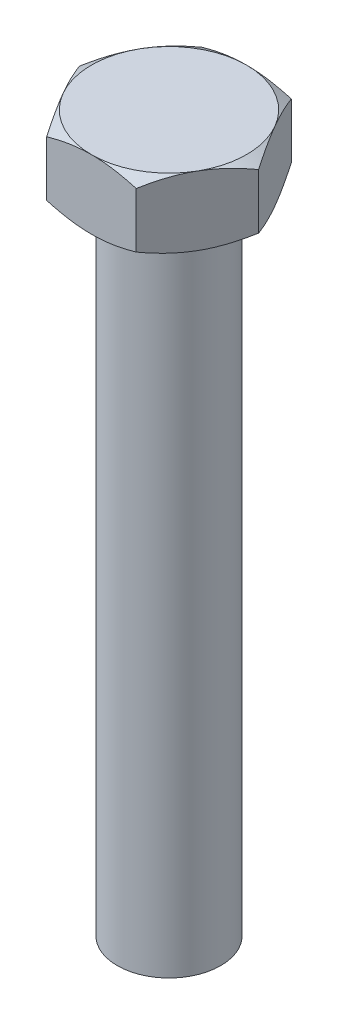
ISO-10303-21;
HEADER;
FILE_DESCRIPTION(('STEP AP214'),'2;1');
FILE_NAME('part.step','',(''),(''),'','','');
FILE_SCHEMA(('AUTOMOTIVE_DESIGN { 1 0 10303 214 1 1 1 1 }'));
ENDSEC;
DATA;
#1=APPLICATION_CONTEXT('core data for automotive mechanical design processes');
#2=APPLICATION_PROTOCOL_DEFINITION('international standard','automotive_design',2000,#1);
#3=PRODUCT_CONTEXT('',#1,'mechanical');
#4=PRODUCT('Part','Part','',(#3));
#5=PRODUCT_RELATED_PRODUCT_CATEGORY('part','',(#4));
#6=PRODUCT_DEFINITION_FORMATION('','',#4);
#7=PRODUCT_DEFINITION_CONTEXT('part definition',#1,'design');
#8=PRODUCT_DEFINITION('design','',#6,#7);
#9=PRODUCT_DEFINITION_SHAPE('','',#8);
#10=(LENGTH_UNIT() NAMED_UNIT(*) SI_UNIT(.MILLI.,.METRE.));
#11=(NAMED_UNIT(*) PLANE_ANGLE_UNIT() SI_UNIT($,.RADIAN.));
#12=(NAMED_UNIT(*) SI_UNIT($,.STERADIAN.) SOLID_ANGLE_UNIT());
#13=UNCERTAINTY_MEASURE_WITH_UNIT(LENGTH_MEASURE(1.E-05),#10,'distance_accuracy_value','');
#14=(GEOMETRIC_REPRESENTATION_CONTEXT(3) GLOBAL_UNCERTAINTY_ASSIGNED_CONTEXT((#13)) GLOBAL_UNIT_ASSIGNED_CONTEXT((#10,
#11,#12)) REPRESENTATION_CONTEXT('',''));
#15=CARTESIAN_POINT('',(0.,0.,0.));
#16=DIRECTION('',(0.,0.,1.));
#17=DIRECTION('',(1.,0.,0.));
#18=AXIS2_PLACEMENT_3D('',#15,#16,#17);
#19=CARTESIAN_POINT('',(0.,0.,0.));
#20=DIRECTION('',(0.,1.,0.));
#21=DIRECTION('',(0.,0.,1.));
#22=AXIS2_PLACEMENT_3D('',#19,#20,#21);
#23=PLANE('',#22);
#24=CARTESIAN_POINT('',(0.,0.,0.));
#25=DIRECTION('',(0.,1.,0.));
#26=DIRECTION('',(0.,0.,1.));
#27=AXIS2_PLACEMENT_3D('',#24,#25,#26);
#28=CIRCLE('',#27,9.);
#29=CARTESIAN_POINT('',(0.,0.,9.));
#30=VERTEX_POINT('',#29);
#31=CARTESIAN_POINT('',(7.79422863405995,0.,4.5));
#32=VERTEX_POINT('',#31);
#33=EDGE_CURVE('E262',#30,#32,#28,.T.);
#34=ORIENTED_EDGE('',*,*,#33,.F.);
#35=CARTESIAN_POINT('',(0.,0.,0.));
#36=DIRECTION('',(0.,1.,0.));
#37=DIRECTION('',(0.,0.,1.));
#38=AXIS2_PLACEMENT_3D('',#35,#36,#37);
#39=CIRCLE('',#38,9.);
#40=CARTESIAN_POINT('',(-7.79422863405995,0.,4.5));
#41=VERTEX_POINT('',#40);
#42=EDGE_CURVE('E289',#30,#41,#39,.F.);
#43=ORIENTED_EDGE('',*,*,#42,.T.);
#44=CARTESIAN_POINT('',(-7.79422863405995,0.,-4.5));
#45=VERTEX_POINT('',#44);
#46=EDGE_CURVE('E293',#41,#45,#39,.F.);
#47=ORIENTED_EDGE('',*,*,#46,.T.);
#48=CARTESIAN_POINT('',(0.,0.,-9.));
#49=VERTEX_POINT('',#48);
#50=EDGE_CURVE('E317',#45,#49,#39,.F.);
#51=ORIENTED_EDGE('',*,*,#50,.T.);
#52=CARTESIAN_POINT('',(7.79422863405995,0.,-4.5));
#53=VERTEX_POINT('',#52);
#54=EDGE_CURVE('E314',#49,#53,#39,.F.);
#55=ORIENTED_EDGE('',*,*,#54,.T.);
#56=EDGE_CURVE('E294',#53,#32,#39,.F.);
#57=ORIENTED_EDGE('',*,*,#56,.T.);
#58=EDGE_LOOP('',(#34,#43,#47,#51,#55,#57));
#59=FACE_BOUND('',#58,.T.);
#60=CARTESIAN_POINT('',(0.,0.,0.));
#61=DIRECTION('',(0.,1.,0.));
#62=DIRECTION('',(0.,0.,1.));
#63=AXIS2_PLACEMENT_3D('',#60,#61,#62);
#64=CIRCLE('',#63,6.);
#65=CARTESIAN_POINT('',(0.,0.,6.));
#66=VERTEX_POINT('',#65);
#67=EDGE_CURVE('E11',#66,#66,#64,.F.);
#68=ORIENTED_EDGE('',*,*,#67,.F.);
#69=EDGE_LOOP('',(#68));
#70=FACE_BOUND('',#69,.T.);
#71=ADVANCED_FACE('F36',(#59,#70),#23,.F.);
#72=CARTESIAN_POINT('',(10.3923048454133,8.,0.));
#73=DIRECTION('',(-0.866025403784438,0.,0.5));
#74=DIRECTION('',(0.5,0.,0.866025403784438));
#75=AXIS2_PLACEMENT_3D('',#72,#73,#74);
#76=PLANE('',#75);
#77=DIRECTION('',(0.,-1.,0.));
#78=VECTOR('',#77,1.);
#79=CARTESIAN_POINT('',(5.19615242270663,8.,-9.));
#80=LINE('',#79,#78);
#81=CARTESIAN_POINT('',(5.19615242270663,7.19615242270664,-9.));
#82=VERTEX_POINT('',#81);
#83=CARTESIAN_POINT('',(5.19615242270663,0.803847577293355,-9.));
#84=VERTEX_POINT('',#83);
#85=EDGE_CURVE('E295',#82,#84,#80,.T.);
#86=ORIENTED_EDGE('',*,*,#85,.F.);
#87=CARTESIAN_POINT('',(5.19603695265279,7.19608575492888,-9.0002));
#88=CARTESIAN_POINT('',(5.31024090414014,7.26201799812596,-8.80239295359879));
#89=CARTESIAN_POINT('',(5.42489028935503,7.3249585907897,-8.60381439335006));
#90=CARTESIAN_POINT('',(5.65512011728599,7.44403100234447,-8.20504463395579));
#91=CARTESIAN_POINT('',(5.77070093910682,7.50015988224795,-8.00485277818155));
#92=CARTESIAN_POINT('',(6.00300811711761,7.60484803927104,-7.60248494290391));
#93=CARTESIAN_POINT('',(6.11973652630803,7.65338922708722,-7.40030540749941));
#94=CARTESIAN_POINT('',(6.35398725476076,7.74185148321209,-6.99457124410926));
#95=CARTESIAN_POINT('',(6.47150940676615,7.78177431251673,-6.7910169058211));
#96=CARTESIAN_POINT('',(6.70436794207327,7.85131532585289,-6.38769409169309));
#97=CARTESIAN_POINT('',(6.81968712510142,7.88116249715221,-6.187955407601));
#98=CARTESIAN_POINT('',(7.05084147798785,7.93120669014092,-5.78758432401101));
#99=CARTESIAN_POINT('',(7.16667660134328,7.95140456446246,-5.5869520050584));
#100=CARTESIAN_POINT('',(7.39854776775318,7.98164565260265,-5.18533936402619));
#101=CARTESIAN_POINT('',(7.51458343241836,7.9917003904157,-4.98435969733607));
#102=CARTESIAN_POINT('',(7.74676155069016,8.00143766485492,-4.58221540008358));
#103=CARTESIAN_POINT('',(7.86290400088661,8.00112052193525,-4.38105077542779));
#104=CARTESIAN_POINT('',(8.08003584616207,7.99083604784683,-4.00496738746951));
#105=CARTESIAN_POINT('',(8.18104055171995,7.98212325996961,-3.83002210563972));
#106=CARTESIAN_POINT('',(8.38281337570171,7.95702265993463,-3.48054132291666));
#107=CARTESIAN_POINT('',(8.4835814777175,7.94063433041933,-3.30600585044304));
#108=CARTESIAN_POINT('',(8.7854956741391,7.88034344376417,-2.7830751227145));
#109=CARTESIAN_POINT('',(8.98610736306936,7.82532251765887,-2.43560548489509));
#110=CARTESIAN_POINT('',(9.38945876049729,7.68776952367485,-1.736980371246));
#111=CARTESIAN_POINT('',(9.59214699192736,7.6046543813729,-1.38591405631283));
#112=CARTESIAN_POINT('',(9.99450087051226,7.41601746056355,-0.689016695981396));
#113=CARTESIAN_POINT('',(10.1941716700214,7.31053998710665,-0.343176726443722));
#114=CARTESIAN_POINT('',(10.3924203154671,7.19608575492888,0.000199999999999235));
#115=B_SPLINE_CURVE_WITH_KNOTS('',3,(#87,#88,#89,#90,#91,#92,#93,#94,#95,#96,#97,#98,#99,#100,
#101,#102,#103,#104,#105,#106,#107,#108,#109,#110,#111,#112,#113,#114),.UNSPECIFIED.,.F.,.F.,(4,
2,2,2,2,2,2,2,2,2,2,2,2,4),(0.,0.713219249102576,1.42674513853509,2.14194697262263,
2.8570025303448,3.55449749123033,4.25193080859214,4.94857085059644,5.64518936892662,
6.25162976378283,6.8581110406634,8.07193747617893,9.31268391793541,10.5509947443908),.UNSPECIFIED.);
#116=CARTESIAN_POINT('',(7.79422863405995,8.,-4.5));
#117=VERTEX_POINT('',#116);
#118=EDGE_CURVE('E136',#82,#117,#115,.T.);
#119=ORIENTED_EDGE('',*,*,#118,.T.);
#120=CARTESIAN_POINT('',(10.3923048454133,7.19615242270664,0.));
#121=VERTEX_POINT('',#120);
#122=EDGE_CURVE('E159',#117,#121,#115,.T.);
#123=ORIENTED_EDGE('',*,*,#122,.T.);
#124=DIRECTION('',(0.,-1.,0.));
#125=VECTOR('',#124,1.);
#126=CARTESIAN_POINT('',(10.3923048454133,8.,0.));
#127=LINE('',#126,#125);
#128=CARTESIAN_POINT('',(10.3923048454133,0.803847577293357,0.));
#129=VERTEX_POINT('',#128);
#130=EDGE_CURVE('E301',#121,#129,#127,.T.);
#131=ORIENTED_EDGE('',*,*,#130,.T.);
#132=CARTESIAN_POINT('',(10.3924203154671,0.803914245071122,0.000200000000000067));
#133=CARTESIAN_POINT('',(10.2782163639798,0.737982001874045,-0.197607046401215));
#134=CARTESIAN_POINT('',(10.1635669787649,0.675041409210303,-0.396185606649944));
#135=CARTESIAN_POINT('',(9.9333371508339,0.555968997655529,-0.794955366044208));
#136=CARTESIAN_POINT('',(9.81775632901308,0.499840117752055,-0.995147221818449));
#137=CARTESIAN_POINT('',(9.58544915100228,0.395151960728955,-1.3975150570961));
#138=CARTESIAN_POINT('',(9.46872074181186,0.34661077291278,-1.59969459250059));
#139=CARTESIAN_POINT('',(9.23447001335913,0.258148516787915,-2.00542875589074));
#140=CARTESIAN_POINT('',(9.11694786135374,0.218225687483269,-2.20898309417891));
#141=CARTESIAN_POINT('',(8.88408932604662,0.148684674147111,-2.61230590830691));
#142=CARTESIAN_POINT('',(8.76877014301847,0.118837502847796,-2.812044592399));
#143=CARTESIAN_POINT('',(8.53761579013205,0.0687933098590787,-3.21241567598899));
#144=CARTESIAN_POINT('',(8.42178066677662,0.0485954355375375,-3.4130479949416));
#145=CARTESIAN_POINT('',(8.18990950036671,0.0183543473973454,-3.81466063597381));
#146=CARTESIAN_POINT('',(8.07387383570154,0.00829960958430131,-4.01564030266393));
#147=CARTESIAN_POINT('',(7.84169571742974,-0.00143766485492003,-4.41778459991642));
#148=CARTESIAN_POINT('',(7.72555326723328,-0.0011205219352464,-4.61894922457221));
#149=CARTESIAN_POINT('',(7.50842142195782,0.00916395215316998,-4.9950326125305));
#150=CARTESIAN_POINT('',(7.40741671639994,0.0178767400303935,-5.16997789436028));
#151=CARTESIAN_POINT('',(7.20564389241818,0.0429773400653662,-5.51945867708334));
#152=CARTESIAN_POINT('',(7.10487579040239,0.0593656695806659,-5.69399414955697));
#153=CARTESIAN_POINT('',(6.8029615939808,0.119656556235827,-6.2169248772855));
#154=CARTESIAN_POINT('',(6.60234990505054,0.174677482341125,-6.56439451510491));
#155=CARTESIAN_POINT('',(6.19899850762261,0.312230476325146,-7.263019628754));
#156=CARTESIAN_POINT('',(5.99631027619253,0.395345618627101,-7.61408594368717));
#157=CARTESIAN_POINT('',(5.59395639760763,0.583982539436453,-8.31098330401861));
#158=CARTESIAN_POINT('',(5.39428559809853,0.689460012893347,-8.65682327355628));
#159=CARTESIAN_POINT('',(5.19603695265279,0.803914245071121,-9.0002));
#160=B_SPLINE_CURVE_WITH_KNOTS('',3,(#132,#133,#134,#135,#136,#137,#138,#139,#140,#141,#142,
#143,#144,#145,#146,#147,#148,#149,#150,#151,#152,#153,#154,#155,#156,#157,#158,#159),
.UNSPECIFIED.,.F.,.F.,(4,2,2,2,2,2,2,2,2,2,2,2,2,4),(0.,0.713219249102576,1.42674513853509,
2.14194697262263,2.8570025303448,3.55449749123033,4.25193080859214,4.94857085059644,
5.64518936892662,6.25162976378283,6.8581110406634,8.07193747617893,9.31268391793542,
10.5509947443908),.UNSPECIFIED.);
#161=EDGE_CURVE('E302',#129,#53,#160,.T.);
#162=ORIENTED_EDGE('',*,*,#161,.T.);
#163=EDGE_CURVE('E235',#53,#84,#160,.T.);
#164=ORIENTED_EDGE('',*,*,#163,.T.);
#165=EDGE_LOOP('',(#86,#119,#123,#131,#162,#164));
#166=FACE_BOUND('',#165,.T.);
#167=ADVANCED_FACE('F38',(#166),#76,.F.);
#168=CARTESIAN_POINT('',(5.19615242270663,8.,-9.));
#169=DIRECTION('',(0.,0.,1.));
#170=DIRECTION('',(1.,0.,0.));
#171=AXIS2_PLACEMENT_3D('',#168,#169,#170);
#172=PLANE('',#171);
#173=DIRECTION('',(0.,-1.,0.));
#174=VECTOR('',#173,1.);
#175=CARTESIAN_POINT('',(-5.19615242270663,8.,-9.));
#176=LINE('',#175,#174);
#177=CARTESIAN_POINT('',(-5.19615242270663,7.19615242270664,-9.));
#178=VERTEX_POINT('',#177);
#179=CARTESIAN_POINT('',(-5.19615242270663,0.803847577293355,-9.));
#180=VERTEX_POINT('',#179);
#181=EDGE_CURVE('E281',#178,#180,#176,.T.);
#182=ORIENTED_EDGE('',*,*,#181,.F.);
#183=CARTESIAN_POINT('',(-13.7809619774074,3.69325965220871,-9.));
#184=CARTESIAN_POINT('',(-13.5833938697395,3.78876114654063,-9.));
#185=CARTESIAN_POINT('',(-13.3855869578229,3.88376837870654,-9.));
#186=CARTESIAN_POINT('',(-12.989445086566,4.07268086462855,-9.));
#187=CARTESIAN_POINT('',(-12.7911101214663,4.16658610630428,-9.));
#188=CARTESIAN_POINT('',(-12.1951793772706,4.44650588462435,-9.));
#189=CARTESIAN_POINT('',(-11.796721983269,4.63069333505562,-9.));
#190=CARTESIAN_POINT('',(-10.9947735410802,4.99406084450525,-9.));
#191=CARTESIAN_POINT('',(-10.5912667360483,5.1732062164546,-9.));
#192=CARTESIAN_POINT('',(-9.78093737078392,5.52380527750532,-9.));
#193=CARTESIAN_POINT('',(-9.37411498469578,5.6952593675386,-9.));
#194=CARTESIAN_POINT('',(-8.55145586737857,6.03046127456711,-9.));
#195=CARTESIAN_POINT('',(-8.1355697851272,6.19408864051043,-9.));
#196=CARTESIAN_POINT('',(-7.29889335630537,6.50852845034204,-9.));
#197=CARTESIAN_POINT('',(-6.8781024700067,6.65933946847863,-9.));
#198=CARTESIAN_POINT('',(-6.03180598391542,6.94409344828315,-9.));
#199=CARTESIAN_POINT('',(-5.60631258356863,7.078072271388,-9.));
#200=CARTESIAN_POINT('',(-4.74929212788305,7.32481294796466,-9.));
#201=CARTESIAN_POINT('',(-4.31776702714833,7.4375815109968,-9.));
#202=CARTESIAN_POINT('',(-3.4483163158746,7.63641882808318,-9.));
#203=CARTESIAN_POINT('',(-3.01038903355476,7.72248047297099,-9.));
#204=CARTESIAN_POINT('',(-2.34964451655234,7.82723357155703,-9.));
#205=CARTESIAN_POINT('',(-2.12872697070446,7.85809698289841,-9.));
#206=CARTESIAN_POINT('',(-1.68585612058644,7.91110341745493,-9.));
#207=CARTESIAN_POINT('',(-1.46390292105946,7.93324730399172,-9.));
#208=CARTESIAN_POINT('',(-1.02066876581626,7.96821876727257,-9.));
#209=CARTESIAN_POINT('',(-0.799392393095608,7.98110419533573,-9.));
#210=CARTESIAN_POINT('',(-0.356492552156385,7.99749061624052,-9.));
#211=CARTESIAN_POINT('',(-0.134869088482686,8.00099173095085,-9.));
#212=CARTESIAN_POINT('',(0.30826369243923,7.99852610163482,-9.));
#213=CARTESIAN_POINT('',(0.529773024266328,7.99256201473658,-9.));
#214=CARTESIAN_POINT('',(0.972347240677034,7.97131429313996,-9.));
#215=CARTESIAN_POINT('',(1.19341210251236,7.95603019303534,-9.));
#216=CARTESIAN_POINT('',(1.72920526251553,7.90801041149163,-9.));
#217=CARTESIAN_POINT('',(2.0435219022808,7.87060507013922,-9.));
#218=CARTESIAN_POINT('',(2.6697466024589,7.77902940688438,-9.));
#219=CARTESIAN_POINT('',(2.98165398160703,7.72485450900374,-9.));
#220=CARTESIAN_POINT('',(3.60280284042324,7.60166114307708,-9.));
#221=CARTESIAN_POINT('',(3.91204150992691,7.53262864034205,-9.));
#222=CARTESIAN_POINT('',(4.52733722239789,7.38182632812686,-9.));
#223=CARTESIAN_POINT('',(4.83339456219527,7.30005771856222,-9.));
#224=CARTESIAN_POINT('',(5.44986573988072,7.12360199212755,-9.));
#225=CARTESIAN_POINT('',(5.76020247160972,7.02864734506991,-9.));
#226=CARTESIAN_POINT('',(6.37759566796883,6.8293559829023,-9.));
#227=CARTESIAN_POINT('',(6.68465423393915,6.7250257389807,-9.));
#228=CARTESIAN_POINT('',(7.29425898475952,6.50913822667547,-9.));
#229=CARTESIAN_POINT('',(7.59682084010898,6.39762494222592,-9.));
#230=CARTESIAN_POINT('',(8.19959709040605,6.16805317855809,-9.));
#231=CARTESIAN_POINT('',(8.49981047984946,6.04999205399538,-9.));
#232=CARTESIAN_POINT('',(8.79893322720038,5.92930473528101,-9.));
#233=B_SPLINE_CURVE_WITH_KNOTS('',3,(#183,#184,#185,#186,#187,#188,#189,#190,#191,#192,#193,
#194,#195,#196,#197,#198,#199,#200,#201,#202,#203,#204,#205,#206,#207,#208,#209,#210,#211,#212,
#213,#214,#215,#216,#217,#218,#219,#220,#221,#222,#223,#224,#225,#226,#227,#228,#229,#230,#231,
#232),.UNSPECIFIED.,.F.,.F.,(4,2,2,2,2,2,2,2,2,2,2,2,2,2,2,2,2,2,2,2,2,2,2,2,4),(0.,
0.658317213383772,1.31664163671153,2.63350462236223,3.9579034830486,5.28223322492244,
6.62282162595725,7.96355896575429,9.30138955920957,10.6387962348218,11.9765586125402,
12.6456025923959,13.3145803134253,13.9793407019702,14.6440924576109,15.3086576331613,
15.9732559973028,16.9223307168753,17.8716646430283,18.82189928942,19.772044464798,
20.7454797518661,21.7182482442909,22.6855413421192,23.6532281165803),.UNSPECIFIED.);
#234=CARTESIAN_POINT('',(0.,8.,-9.));
#235=VERTEX_POINT('',#234);
#236=EDGE_CURVE('E254',#178,#235,#233,.T.);
#237=ORIENTED_EDGE('',*,*,#236,.T.);
#238=EDGE_CURVE('E248',#235,#82,#233,.T.);
#239=ORIENTED_EDGE('',*,*,#238,.T.);
#240=ORIENTED_EDGE('',*,*,#85,.T.);
#241=CARTESIAN_POINT('',(-13.7809619774074,4.30674034779129,-9.));
#242=CARTESIAN_POINT('',(-13.5833938697395,4.21123885345937,-9.));
#243=CARTESIAN_POINT('',(-13.3855869578229,4.11623162129346,-9.));
#244=CARTESIAN_POINT('',(-12.989445086566,3.92731913537145,-9.));
#245=CARTESIAN_POINT('',(-12.7911101214663,3.83341389369572,-9.));
#246=CARTESIAN_POINT('',(-12.1951793772706,3.55349411537565,-9.));
#247=CARTESIAN_POINT('',(-11.796721983269,3.36930666494438,-9.));
#248=CARTESIAN_POINT('',(-10.9947735410802,3.00593915549475,-9.));
#249=CARTESIAN_POINT('',(-10.5912667360483,2.8267937835454,-9.));
#250=CARTESIAN_POINT('',(-9.78093737078392,2.47619472249468,-9.));
#251=CARTESIAN_POINT('',(-9.37411498469579,2.3047406324614,-9.));
#252=CARTESIAN_POINT('',(-8.55145586737857,1.96953872543289,-9.));
#253=CARTESIAN_POINT('',(-8.1355697851272,1.80591135948957,-9.));
#254=CARTESIAN_POINT('',(-7.29889335630537,1.49147154965796,-9.));
#255=CARTESIAN_POINT('',(-6.8781024700067,1.34066053152137,-9.));
#256=CARTESIAN_POINT('',(-6.03180598391543,1.05590655171685,-9.));
#257=CARTESIAN_POINT('',(-5.60631258356863,0.921927728611999,-9.));
#258=CARTESIAN_POINT('',(-4.74929212788305,0.675187052035339,-9.));
#259=CARTESIAN_POINT('',(-4.31776702714833,0.562418489003201,-9.));
#260=CARTESIAN_POINT('',(-3.4483163158746,0.363581171916822,-9.));
#261=CARTESIAN_POINT('',(-3.01038903355476,0.277519527029011,-9.));
#262=CARTESIAN_POINT('',(-2.34964451655233,0.172766428442972,-9.));
#263=CARTESIAN_POINT('',(-2.12872697070446,0.14190301710159,-9.));
#264=CARTESIAN_POINT('',(-1.68585612058643,0.088896582545075,-9.));
#265=CARTESIAN_POINT('',(-1.46390292105946,0.0667526960082838,-9.));
#266=CARTESIAN_POINT('',(-1.02066876581626,0.0317812327274289,-9.));
#267=CARTESIAN_POINT('',(-0.799392393095607,0.0188958046642675,-9.));
#268=CARTESIAN_POINT('',(-0.356492552156383,0.00250938375947598,-9.));
#269=CARTESIAN_POINT('',(-0.134869088482685,-0.000991730950855281,-9.));
#270=CARTESIAN_POINT('',(0.308263692439232,0.00147389836518329,-9.));
#271=CARTESIAN_POINT('',(0.529773024266329,0.00743798526342126,-9.));
#272=CARTESIAN_POINT('',(0.972347240677035,0.0286857068600393,-9.));
#273=CARTESIAN_POINT('',(1.19341210251236,0.0439698069646553,-9.));
#274=CARTESIAN_POINT('',(1.72920526251553,0.0919895885083686,-9.));
#275=CARTESIAN_POINT('',(2.04352190228081,0.12939492986078,-9.));
#276=CARTESIAN_POINT('',(2.66974660245891,0.220970593115619,-9.));
#277=CARTESIAN_POINT('',(2.98165398160704,0.275145490996256,-9.));
#278=CARTESIAN_POINT('',(3.60280284042324,0.398338856922922,-9.));
#279=CARTESIAN_POINT('',(3.91204150992691,0.467371359657952,-9.));
#280=CARTESIAN_POINT('',(4.52733722239789,0.618173671873143,-9.));
#281=CARTESIAN_POINT('',(4.83339456219527,0.699942281437784,-9.));
#282=CARTESIAN_POINT('',(5.44986573988072,0.876398007872448,-9.));
#283=CARTESIAN_POINT('',(5.76020247160971,0.971352654930088,-9.));
#284=CARTESIAN_POINT('',(6.37759566796883,1.1706440170977,-9.));
#285=CARTESIAN_POINT('',(6.68465423393915,1.2749742610193,-9.));
#286=CARTESIAN_POINT('',(7.29425898475952,1.49086177332454,-9.));
#287=CARTESIAN_POINT('',(7.59682084010898,1.60237505777408,-9.));
#288=CARTESIAN_POINT('',(8.19959709040605,1.83194682144191,-9.));
#289=CARTESIAN_POINT('',(8.49981047984946,1.95000794600462,-9.));
#290=CARTESIAN_POINT('',(8.79893322720038,2.07069526471899,-9.));
#291=B_SPLINE_CURVE_WITH_KNOTS('',3,(#241,#242,#243,#244,#245,#246,#247,#248,#249,#250,#251,
#252,#253,#254,#255,#256,#257,#258,#259,#260,#261,#262,#263,#264,#265,#266,#267,#268,#269,#270,
#271,#272,#273,#274,#275,#276,#277,#278,#279,#280,#281,#282,#283,#284,#285,#286,#287,#288,#289,
#290),.UNSPECIFIED.,.F.,.F.,(4,2,2,2,2,2,2,2,2,2,2,2,2,2,2,2,2,2,2,2,2,2,2,2,4),(0.,
0.658317213383774,1.31664163671153,2.63350462236223,3.9579034830486,5.28223322492243,
6.62282162595725,7.96355896575429,9.30138955920957,10.6387962348218,11.9765586125402,
12.6456025923959,13.3145803134253,13.9793407019702,14.6440924576109,15.3086576331613,
15.9732559973028,16.9223307168753,17.8716646430283,18.82189928942,19.772044464798,
20.7454797518661,21.7182482442909,22.6855413421192,23.6532281165803),.UNSPECIFIED.);
#292=EDGE_CURVE('E233',#84,#49,#291,.F.);
#293=ORIENTED_EDGE('',*,*,#292,.T.);
#294=EDGE_CURVE('E228',#49,#180,#291,.F.);
#295=ORIENTED_EDGE('',*,*,#294,.T.);
#296=EDGE_LOOP('',(#182,#237,#239,#240,#293,#295));
#297=FACE_BOUND('',#296,.T.);
#298=ADVANCED_FACE('F240',(#297),#172,.F.);
#299=CARTESIAN_POINT('',(-5.19615242270663,8.,-9.));
#300=DIRECTION('',(0.866025403784438,0.,0.5));
#301=DIRECTION('',(0.5,0.,-0.866025403784439));
#302=AXIS2_PLACEMENT_3D('',#299,#300,#301);
#303=PLANE('',#302);
#304=DIRECTION('',(0.,-1.,0.));
#305=VECTOR('',#304,1.);
#306=CARTESIAN_POINT('',(-10.3923048454133,8.,0.));
#307=LINE('',#306,#305);
#308=CARTESIAN_POINT('',(-10.3923048454133,7.19615242270664,0.));
#309=VERTEX_POINT('',#308);
#310=CARTESIAN_POINT('',(-10.3923048454133,0.803847577293355,0.));
#311=VERTEX_POINT('',#310);
#312=EDGE_CURVE('E275',#309,#311,#307,.T.);
#313=ORIENTED_EDGE('',*,*,#312,.F.);
#314=CARTESIAN_POINT('',(-10.3924203154671,7.19608575492888,0.000199999999998265));
#315=CARTESIAN_POINT('',(-10.2782163639798,7.26201799812596,-0.197607046401218));
#316=CARTESIAN_POINT('',(-10.1635669787649,7.3249585907897,-0.396185606649945));
#317=CARTESIAN_POINT('',(-9.9333371508339,7.44403100234447,-0.79495536604421));
#318=CARTESIAN_POINT('',(-9.81775632901307,7.50015988224795,-0.99514722181845));
#319=CARTESIAN_POINT('',(-9.58544915100228,7.60484803927104,-1.3975150570961));
#320=CARTESIAN_POINT('',(-9.46872074181186,7.65338922708722,-1.5996945925006));
#321=CARTESIAN_POINT('',(-9.23447001335913,7.74185148321208,-2.00542875589074));
#322=CARTESIAN_POINT('',(-9.11694786135374,7.78177431251673,-2.20898309417891));
#323=CARTESIAN_POINT('',(-8.88408932604662,7.85131532585289,-2.61230590830691));
#324=CARTESIAN_POINT('',(-8.76877014301847,7.8811624971522,-2.812044592399));
#325=CARTESIAN_POINT('',(-8.53761579013205,7.93120669014092,-3.21241567598899));
#326=CARTESIAN_POINT('',(-8.42178066677662,7.95140456446246,-3.4130479949416));
#327=CARTESIAN_POINT('',(-8.18990950036671,7.98164565260265,-3.81466063597381));
#328=CARTESIAN_POINT('',(-8.07387383570153,7.9917003904157,-4.01564030266393));
#329=CARTESIAN_POINT('',(-7.84169571742973,8.00143766485492,-4.41778459991642));
#330=CARTESIAN_POINT('',(-7.72555326723328,8.00112052193525,-4.61894922457222));
#331=CARTESIAN_POINT('',(-7.50842142195782,7.99083604784683,-4.9950326125305));
#332=CARTESIAN_POINT('',(-7.40741671639994,7.98212325996961,-5.16997789436029));
#333=CARTESIAN_POINT('',(-7.20564389241818,7.95702265993463,-5.51945867708334));
#334=CARTESIAN_POINT('',(-7.10487579040239,7.94063433041933,-5.69399414955697));
#335=CARTESIAN_POINT('',(-6.8029615939808,7.88034344376417,-6.2169248772855));
#336=CARTESIAN_POINT('',(-6.60234990505054,7.82532251765888,-6.56439451510491));
#337=CARTESIAN_POINT('',(-6.1989985076226,7.68776952367485,-7.263019628754));
#338=CARTESIAN_POINT('',(-5.99631027619253,7.6046543813729,-7.61408594368717));
#339=CARTESIAN_POINT('',(-5.59395639760763,7.41601746056355,-8.31098330401861));
#340=CARTESIAN_POINT('',(-5.39428559809853,7.31053998710665,-8.65682327355628));
#341=CARTESIAN_POINT('',(-5.19603695265279,7.19608575492888,-9.0002));
#342=B_SPLINE_CURVE_WITH_KNOTS('',3,(#314,#315,#316,#317,#318,#319,#320,#321,#322,#323,#324,
#325,#326,#327,#328,#329,#330,#331,#332,#333,#334,#335,#336,#337,#338,#339,#340,#341),
.UNSPECIFIED.,.F.,.F.,(4,2,2,2,2,2,2,2,2,2,2,2,2,4),(0.,0.713219249102576,1.42674513853509,
2.14194697262262,2.8570025303448,3.55449749123033,4.25193080859214,4.94857085059644,
5.64518936892662,6.25162976378283,6.8581110406634,8.07193747617893,9.31268391793541,
10.5509947443908),.UNSPECIFIED.);
#343=CARTESIAN_POINT('',(-7.79422863405995,8.,-4.5));
#344=VERTEX_POINT('',#343);
#345=EDGE_CURVE('E261',#309,#344,#342,.T.);
#346=ORIENTED_EDGE('',*,*,#345,.T.);
#347=EDGE_CURVE('E60',#344,#178,#342,.T.);
#348=ORIENTED_EDGE('',*,*,#347,.T.);
#349=ORIENTED_EDGE('',*,*,#181,.T.);
#350=CARTESIAN_POINT('',(-5.19603695265279,0.803914245071121,-9.0002));
#351=CARTESIAN_POINT('',(-5.31024090414014,0.737982001874043,-8.80239295359879));
#352=CARTESIAN_POINT('',(-5.42489028935503,0.675041409210301,-8.60381439335006));
#353=CARTESIAN_POINT('',(-5.65512011728599,0.555968997655527,-8.20504463395579));
#354=CARTESIAN_POINT('',(-5.77070093910682,0.499840117752054,-8.00485277818155));
#355=CARTESIAN_POINT('',(-6.00300811711761,0.395151960728956,-7.60248494290391));
#356=CARTESIAN_POINT('',(-6.11973652630804,0.34661077291278,-7.40030540749941));
#357=CARTESIAN_POINT('',(-6.35398725476077,0.258148516787915,-6.99457124410926));
#358=CARTESIAN_POINT('',(-6.47150940676615,0.218225687483269,-6.79101690582109));
#359=CARTESIAN_POINT('',(-6.70436794207327,0.14868467414711,-6.38769409169309));
#360=CARTESIAN_POINT('',(-6.81968712510142,0.118837502847796,-6.187955407601));
#361=CARTESIAN_POINT('',(-7.05084147798785,0.0687933098590789,-5.78758432401101));
#362=CARTESIAN_POINT('',(-7.16667660134328,0.0485954355375373,-5.5869520050584));
#363=CARTESIAN_POINT('',(-7.39854776775318,0.0183543473973453,-5.18533936402619));
#364=CARTESIAN_POINT('',(-7.51458343241836,0.0082996095843017,-4.98435969733607));
#365=CARTESIAN_POINT('',(-7.74676155069016,-0.00143766485491941,-4.58221540008358));
#366=CARTESIAN_POINT('',(-7.86290400088661,-0.00112052193524602,-4.38105077542779));
#367=CARTESIAN_POINT('',(-8.08003584616207,0.00916395215317059,-4.00496738746951));
#368=CARTESIAN_POINT('',(-8.18104055171995,0.0178767400303945,-3.83002210563972));
#369=CARTESIAN_POINT('',(-8.38281337570171,0.0429773400653672,-3.48054132291666));
#370=CARTESIAN_POINT('',(-8.4835814777175,0.0593656695806667,-3.30600585044304));
#371=CARTESIAN_POINT('',(-8.7854956741391,0.119656556235827,-2.7830751227145));
#372=CARTESIAN_POINT('',(-8.98610736306936,0.174677482341125,-2.43560548489509));
#373=CARTESIAN_POINT('',(-9.38945876049729,0.312230476325146,-1.736980371246));
#374=CARTESIAN_POINT('',(-9.59214699192736,0.395345618627101,-1.38591405631283));
#375=CARTESIAN_POINT('',(-9.99450087051226,0.583982539436454,-0.689016695981397));
#376=CARTESIAN_POINT('',(-10.1941716700214,0.689460012893348,-0.343176726443723));
#377=CARTESIAN_POINT('',(-10.3924203154671,0.803914245071121,0.000199999999997986));
#378=B_SPLINE_CURVE_WITH_KNOTS('',3,(#350,#351,#352,#353,#354,#355,#356,#357,#358,#359,#360,
#361,#362,#363,#364,#365,#366,#367,#368,#369,#370,#371,#372,#373,#374,#375,#376,#377),
.UNSPECIFIED.,.F.,.F.,(4,2,2,2,2,2,2,2,2,2,2,2,2,4),(0.,0.713219249102576,1.42674513853509,
2.14194697262263,2.8570025303448,3.55449749123033,4.25193080859214,4.94857085059644,
5.64518936892662,6.25162976378283,6.8581110406634,8.07193747617893,9.31268391793541,
10.5509947443908),.UNSPECIFIED.);
#379=EDGE_CURVE('E234',#180,#45,#378,.T.);
#380=ORIENTED_EDGE('',*,*,#379,.T.);
#381=EDGE_CURVE('E223',#45,#311,#378,.T.);
#382=ORIENTED_EDGE('',*,*,#381,.T.);
#383=EDGE_LOOP('',(#313,#346,#348,#349,#380,#382));
#384=FACE_BOUND('',#383,.T.);
#385=ADVANCED_FACE('F243',(#384),#303,.F.);
#386=CARTESIAN_POINT('',(-10.3923048454133,8.,0.));
#387=DIRECTION('',(0.866025403784438,0.,-0.5));
#388=DIRECTION('',(-0.5,0.,-0.866025403784439));
#389=AXIS2_PLACEMENT_3D('',#386,#387,#388);
#390=PLANE('',#389);
#391=DIRECTION('',(0.,-1.,0.));
#392=VECTOR('',#391,1.);
#393=CARTESIAN_POINT('',(-5.19615242270663,8.,9.));
#394=LINE('',#393,#392);
#395=CARTESIAN_POINT('',(-5.19615242270664,7.19615242270664,9.));
#396=VERTEX_POINT('',#395);
#397=CARTESIAN_POINT('',(-5.19615242270664,0.803847577293355,9.));
#398=VERTEX_POINT('',#397);
#399=EDGE_CURVE('E299',#396,#398,#394,.T.);
#400=ORIENTED_EDGE('',*,*,#399,.F.);
#401=CARTESIAN_POINT('',(-5.19603695265279,7.19608575492888,9.0002));
#402=CARTESIAN_POINT('',(-5.31024090414014,7.26201799812596,8.80239295359878));
#403=CARTESIAN_POINT('',(-5.42489028935503,7.3249585907897,8.60381439335005));
#404=CARTESIAN_POINT('',(-5.65512011728599,7.44403100234447,8.20504463395579));
#405=CARTESIAN_POINT('',(-5.77070093910682,7.50015988224795,8.00485277818155));
#406=CARTESIAN_POINT('',(-6.00300811711761,7.60484803927105,7.6024849429039));
#407=CARTESIAN_POINT('',(-6.11973652630803,7.65338922708722,7.40030540749941));
#408=CARTESIAN_POINT('',(-6.35398725476076,7.74185148321209,6.99457124410926));
#409=CARTESIAN_POINT('',(-6.47150940676615,7.78177431251673,6.79101690582109));
#410=CARTESIAN_POINT('',(-6.70436794207327,7.85131532585289,6.38769409169309));
#411=CARTESIAN_POINT('',(-6.81968712510142,7.88116249715221,6.187955407601));
#412=CARTESIAN_POINT('',(-7.05084147798785,7.93120669014092,5.78758432401101));
#413=CARTESIAN_POINT('',(-7.16667660134327,7.95140456446246,5.5869520050584));
#414=CARTESIAN_POINT('',(-7.39854776775318,7.98164565260266,5.18533936402619));
#415=CARTESIAN_POINT('',(-7.51458343241836,7.9917003904157,4.98435969733607));
#416=CARTESIAN_POINT('',(-7.74676155069016,8.00143766485492,4.58221540008358));
#417=CARTESIAN_POINT('',(-7.86290400088661,8.00112052193525,4.38105077542778));
#418=CARTESIAN_POINT('',(-8.08003584616207,7.99083604784683,4.0049673874695));
#419=CARTESIAN_POINT('',(-8.18104055171995,7.98212325996961,3.83002210563972));
#420=CARTESIAN_POINT('',(-8.38281337570171,7.95702265993463,3.48054132291666));
#421=CARTESIAN_POINT('',(-8.4835814777175,7.94063433041933,3.30600585044303));
#422=CARTESIAN_POINT('',(-8.78549567413909,7.88034344376417,2.7830751227145));
#423=CARTESIAN_POINT('',(-8.98610736306935,7.82532251765887,2.43560548489509));
#424=CARTESIAN_POINT('',(-9.38945876049729,7.68776952367485,1.736980371246));
#425=CARTESIAN_POINT('',(-9.59214699192736,7.6046543813729,1.38591405631283));
#426=CARTESIAN_POINT('',(-9.99450087051226,7.41601746056355,0.689016695981395));
#427=CARTESIAN_POINT('',(-10.1941716700214,7.31053998710665,0.343176726443721));
#428=CARTESIAN_POINT('',(-10.3924203154671,7.19608575492888,-0.000200000000001967));
#429=B_SPLINE_CURVE_WITH_KNOTS('',3,(#401,#402,#403,#404,#405,#406,#407,#408,#409,#410,#411,
#412,#413,#414,#415,#416,#417,#418,#419,#420,#421,#422,#423,#424,#425,#426,#427,#428),
.UNSPECIFIED.,.F.,.F.,(4,2,2,2,2,2,2,2,2,2,2,2,2,4),(0.,0.713219249102576,1.42674513853509,
2.14194697262262,2.8570025303448,3.55449749123033,4.25193080859214,4.94857085059644,
5.64518936892661,6.25162976378283,6.8581110406634,8.07193747617893,9.31268391793541,
10.5509947443908),.UNSPECIFIED.);
#430=CARTESIAN_POINT('',(-7.79422863405995,8.,4.5));
#431=VERTEX_POINT('',#430);
#432=EDGE_CURVE('E132',#396,#431,#429,.T.);
#433=ORIENTED_EDGE('',*,*,#432,.T.);
#434=EDGE_CURVE('E52',#431,#309,#429,.T.);
#435=ORIENTED_EDGE('',*,*,#434,.T.);
#436=ORIENTED_EDGE('',*,*,#312,.T.);
#437=CARTESIAN_POINT('',(-10.3924203154671,0.803914245071121,-0.000200000000001773));
#438=CARTESIAN_POINT('',(-10.2782163639798,0.737982001874043,0.197607046401214));
#439=CARTESIAN_POINT('',(-10.1635669787649,0.675041409210301,0.396185606649942));
#440=CARTESIAN_POINT('',(-9.9333371508339,0.555968997655527,0.794955366044206));
#441=CARTESIAN_POINT('',(-9.81775632901307,0.499840117752054,0.995147221818447));
#442=CARTESIAN_POINT('',(-9.58544915100228,0.395151960728955,1.39751505709609));
#443=CARTESIAN_POINT('',(-9.46872074181186,0.346610772912779,1.59969459250059));
#444=CARTESIAN_POINT('',(-9.23447001335913,0.258148516787915,2.00542875589074));
#445=CARTESIAN_POINT('',(-9.11694786135374,0.218225687483269,2.2089830941789));
#446=CARTESIAN_POINT('',(-8.88408932604662,0.14868467414711,2.61230590830691));
#447=CARTESIAN_POINT('',(-8.76877014301847,0.118837502847795,2.812044592399));
#448=CARTESIAN_POINT('',(-8.53761579013205,0.0687933098590776,3.21241567598899));
#449=CARTESIAN_POINT('',(-8.42178066677662,0.0485954355375357,3.4130479949416));
#450=CARTESIAN_POINT('',(-8.18990950036671,0.0183543473973436,3.81466063597381));
#451=CARTESIAN_POINT('',(-8.07387383570153,0.00829960958430026,4.01564030266393));
#452=CARTESIAN_POINT('',(-7.84169571742973,-0.00143766485492047,4.41778459991642));
#453=CARTESIAN_POINT('',(-7.72555326723328,-0.00112052193524696,4.61894922457221));
#454=CARTESIAN_POINT('',(-7.50842142195782,0.00916395215316907,4.99503261253049));
#455=CARTESIAN_POINT('',(-7.40741671639994,0.0178767400303923,5.16997789436028));
#456=CARTESIAN_POINT('',(-7.20564389241818,0.0429773400653649,5.51945867708334));
#457=CARTESIAN_POINT('',(-7.10487579040239,0.0593656695806647,5.69399414955696));
#458=CARTESIAN_POINT('',(-6.8029615939808,0.119656556235825,6.2169248772855));
#459=CARTESIAN_POINT('',(-6.60234990505054,0.174677482341122,6.56439451510491));
#460=CARTESIAN_POINT('',(-6.19899850762261,0.312230476325143,7.26301962875399));
#461=CARTESIAN_POINT('',(-5.99631027619253,0.395345618627099,7.61408594368716));
#462=CARTESIAN_POINT('',(-5.59395639760764,0.583982539436451,8.3109833040186));
#463=CARTESIAN_POINT('',(-5.39428559809853,0.689460012893346,8.65682327355627));
#464=CARTESIAN_POINT('',(-5.19603695265279,0.803914245071118,9.0002));
#465=B_SPLINE_CURVE_WITH_KNOTS('',3,(#437,#438,#439,#440,#441,#442,#443,#444,#445,#446,#447,
#448,#449,#450,#451,#452,#453,#454,#455,#456,#457,#458,#459,#460,#461,#462,#463,#464),
.UNSPECIFIED.,.F.,.F.,(4,2,2,2,2,2,2,2,2,2,2,2,2,4),(0.,0.713219249102575,1.42674513853509,
2.14194697262263,2.8570025303448,3.55449749123033,4.25193080859214,4.94857085059644,
5.64518936892662,6.25162976378283,6.8581110406634,8.07193747617893,9.31268391793541,
10.5509947443908),.UNSPECIFIED.);
#466=EDGE_CURVE('E326',#311,#41,#465,.T.);
#467=ORIENTED_EDGE('',*,*,#466,.T.);
#468=EDGE_CURVE('E205',#41,#398,#465,.T.);
#469=ORIENTED_EDGE('',*,*,#468,.T.);
#470=EDGE_LOOP('',(#400,#433,#435,#436,#467,#469));
#471=FACE_BOUND('',#470,.T.);
#472=ADVANCED_FACE('F185',(#471),#390,.F.);
#473=CARTESIAN_POINT('',(-5.19615242270663,8.,9.));
#474=DIRECTION('',(0.,0.,-1.));
#475=DIRECTION('',(-1.,0.,0.));
#476=AXIS2_PLACEMENT_3D('',#473,#474,#475);
#477=PLANE('',#476);
#478=DIRECTION('',(0.,-1.,0.));
#479=VECTOR('',#478,1.);
#480=CARTESIAN_POINT('',(5.19615242270664,8.,9.));
#481=LINE('',#480,#479);
#482=CARTESIAN_POINT('',(5.19615242270664,7.19615242270664,9.));
#483=VERTEX_POINT('',#482);
#484=CARTESIAN_POINT('',(5.19615242270663,0.803847577293355,9.));
#485=VERTEX_POINT('',#484);
#486=EDGE_CURVE('E158',#483,#485,#481,.T.);
#487=ORIENTED_EDGE('',*,*,#486,.F.);
#488=CARTESIAN_POINT('',(-13.7809619774074,3.69325965220872,9.));
#489=CARTESIAN_POINT('',(-13.5833938697395,3.78876114654063,9.));
#490=CARTESIAN_POINT('',(-13.3855869578229,3.88376837870655,9.));
#491=CARTESIAN_POINT('',(-12.989445086566,4.07268086462855,9.));
#492=CARTESIAN_POINT('',(-12.7911101214662,4.16658610630429,9.));
#493=CARTESIAN_POINT('',(-12.1951793772706,4.44650588462435,9.));
#494=CARTESIAN_POINT('',(-11.796721983269,4.63069333505562,9.));
#495=CARTESIAN_POINT('',(-10.9947735410802,4.99406084450526,9.));
#496=CARTESIAN_POINT('',(-10.5912667360483,5.17320621645461,9.));
#497=CARTESIAN_POINT('',(-9.78093737078391,5.52380527750533,9.));
#498=CARTESIAN_POINT('',(-9.37411498469578,5.6952593675386,9.));
#499=CARTESIAN_POINT('',(-8.55145586737856,6.03046127456712,9.));
#500=CARTESIAN_POINT('',(-8.13556978512719,6.19408864051044,9.));
#501=CARTESIAN_POINT('',(-7.29889335630536,6.50852845034204,9.));
#502=CARTESIAN_POINT('',(-6.87810247000669,6.65933946847864,9.));
#503=CARTESIAN_POINT('',(-6.03180598391542,6.94409344828316,9.));
#504=CARTESIAN_POINT('',(-5.60631258356863,7.078072271388,9.));
#505=CARTESIAN_POINT('',(-4.74929212788305,7.32481294796466,9.));
#506=CARTESIAN_POINT('',(-4.31776702714833,7.4375815109968,9.));
#507=CARTESIAN_POINT('',(-3.44831631587459,7.63641882808318,9.));
#508=CARTESIAN_POINT('',(-3.01038903355476,7.72248047297099,9.));
#509=CARTESIAN_POINT('',(-2.34964451655233,7.82723357155703,9.));
#510=CARTESIAN_POINT('',(-2.12872697070446,7.85809698289841,9.));
#511=CARTESIAN_POINT('',(-1.68585612058643,7.91110341745493,9.));
#512=CARTESIAN_POINT('',(-1.46390292105946,7.93324730399172,9.));
#513=CARTESIAN_POINT('',(-1.02066876581626,7.96821876727257,9.));
#514=CARTESIAN_POINT('',(-0.799392393095607,7.98110419533573,9.));
#515=CARTESIAN_POINT('',(-0.356492552156384,7.99749061624053,9.));
#516=CARTESIAN_POINT('',(-0.134869088482685,8.00099173095086,9.));
#517=CARTESIAN_POINT('',(0.308263692439231,7.99852610163482,9.));
#518=CARTESIAN_POINT('',(0.529773024266328,7.99256201473658,9.));
#519=CARTESIAN_POINT('',(0.972347240677034,7.97131429313996,9.));
#520=CARTESIAN_POINT('',(1.19341210251236,7.95603019303535,9.));
#521=CARTESIAN_POINT('',(1.72920526251553,7.90801041149163,9.));
#522=CARTESIAN_POINT('',(2.0435219022808,7.87060507013922,9.));
#523=CARTESIAN_POINT('',(2.6697466024589,7.77902940688438,9.));
#524=CARTESIAN_POINT('',(2.98165398160703,7.72485450900375,9.));
#525=CARTESIAN_POINT('',(3.60280284042324,7.60166114307708,9.));
#526=CARTESIAN_POINT('',(3.91204150992691,7.53262864034205,9.));
#527=CARTESIAN_POINT('',(4.52733722239788,7.38182632812686,9.));
#528=CARTESIAN_POINT('',(4.83339456219526,7.30005771856222,9.));
#529=CARTESIAN_POINT('',(5.44986573988072,7.12360199212756,9.));
#530=CARTESIAN_POINT('',(5.76020247160971,7.02864734506991,9.));
#531=CARTESIAN_POINT('',(6.37759566796882,6.8293559829023,9.));
#532=CARTESIAN_POINT('',(6.68465423393914,6.72502573898071,9.));
#533=CARTESIAN_POINT('',(7.29425898475952,6.50913822667547,9.));
#534=CARTESIAN_POINT('',(7.59682084010898,6.39762494222593,9.));
#535=CARTESIAN_POINT('',(8.19959709040604,6.16805317855809,9.));
#536=CARTESIAN_POINT('',(8.49981047984945,6.04999205399539,9.));
#537=CARTESIAN_POINT('',(8.79893322720037,5.92930473528101,9.));
#538=B_SPLINE_CURVE_WITH_KNOTS('',3,(#488,#489,#490,#491,#492,#493,#494,#495,#496,#497,#498,
#499,#500,#501,#502,#503,#504,#505,#506,#507,#508,#509,#510,#511,#512,#513,#514,#515,#516,#517,
#518,#519,#520,#521,#522,#523,#524,#525,#526,#527,#528,#529,#530,#531,#532,#533,#534,#535,#536,
#537),.UNSPECIFIED.,.F.,.F.,(4,2,2,2,2,2,2,2,2,2,2,2,2,2,2,2,2,2,2,2,2,2,2,2,4),(0.,
0.658317213383774,1.31664163671153,2.63350462236223,3.9579034830486,5.28223322492244,
6.62282162595725,7.96355896575429,9.30138955920957,10.6387962348218,11.9765586125402,
12.6456025923959,13.3145803134253,13.9793407019702,14.6440924576109,15.3086576331613,
15.9732559973028,16.9223307168753,17.8716646430283,18.82189928942,19.772044464798,
20.7454797518661,21.7182482442909,22.6855413421192,23.6532281165803),.UNSPECIFIED.);
#539=CARTESIAN_POINT('',(0.,8.,9.));
#540=VERTEX_POINT('',#539);
#541=EDGE_CURVE('E138',#483,#540,#538,.F.);
#542=ORIENTED_EDGE('',*,*,#541,.T.);
#543=EDGE_CURVE('E126',#540,#396,#538,.F.);
#544=ORIENTED_EDGE('',*,*,#543,.T.);
#545=ORIENTED_EDGE('',*,*,#399,.T.);
#546=CARTESIAN_POINT('',(-13.7809619774074,4.30674034779128,9.));
#547=CARTESIAN_POINT('',(-13.5833938697395,4.21123885345937,9.));
#548=CARTESIAN_POINT('',(-13.3855869578229,4.11623162129346,9.));
#549=CARTESIAN_POINT('',(-12.989445086566,3.92731913537145,9.));
#550=CARTESIAN_POINT('',(-12.7911101214662,3.83341389369571,9.));
#551=CARTESIAN_POINT('',(-12.1951793772706,3.55349411537565,9.));
#552=CARTESIAN_POINT('',(-11.796721983269,3.36930666494438,9.));
#553=CARTESIAN_POINT('',(-10.9947735410802,3.00593915549475,9.));
#554=CARTESIAN_POINT('',(-10.5912667360483,2.82679378354539,9.));
#555=CARTESIAN_POINT('',(-9.78093737078391,2.47619472249467,9.));
#556=CARTESIAN_POINT('',(-9.37411498469578,2.3047406324614,9.));
#557=CARTESIAN_POINT('',(-8.55145586737857,1.96953872543288,9.));
#558=CARTESIAN_POINT('',(-8.13556978512719,1.80591135948956,9.));
#559=CARTESIAN_POINT('',(-7.29889335630536,1.49147154965796,9.));
#560=CARTESIAN_POINT('',(-6.87810247000669,1.34066053152136,9.));
#561=CARTESIAN_POINT('',(-6.03180598391542,1.05590655171684,9.));
#562=CARTESIAN_POINT('',(-5.60631258356863,0.921927728611996,9.));
#563=CARTESIAN_POINT('',(-4.74929212788305,0.675187052035336,9.));
#564=CARTESIAN_POINT('',(-4.31776702714833,0.562418489003198,9.));
#565=CARTESIAN_POINT('',(-3.44831631587459,0.36358117191682,9.));
#566=CARTESIAN_POINT('',(-3.01038903355476,0.277519527029009,9.));
#567=CARTESIAN_POINT('',(-2.34964451655233,0.17276642844297,9.));
#568=CARTESIAN_POINT('',(-2.12872697070445,0.141903017101588,9.));
#569=CARTESIAN_POINT('',(-1.68585612058643,0.0888965825450732,9.));
#570=CARTESIAN_POINT('',(-1.46390292105946,0.0667526960082825,9.));
#571=CARTESIAN_POINT('',(-1.02066876581626,0.0317812327274282,9.));
#572=CARTESIAN_POINT('',(-0.799392393095605,0.0188958046642667,9.));
#573=CARTESIAN_POINT('',(-0.356492552156382,0.00250938375947473,9.));
#574=CARTESIAN_POINT('',(-0.134869088482684,-0.000991730950857078,9.));
#575=CARTESIAN_POINT('',(0.308263692439232,0.00147389836518109,9.));
#576=CARTESIAN_POINT('',(0.529773024266329,0.0074379852634192,9.));
#577=CARTESIAN_POINT('',(0.972347240677035,0.0286857068600374,9.));
#578=CARTESIAN_POINT('',(1.19341210251236,0.0439698069646533,9.));
#579=CARTESIAN_POINT('',(1.72920526251553,0.0919895885083663,9.));
#580=CARTESIAN_POINT('',(2.0435219022808,0.129394929860777,9.));
#581=CARTESIAN_POINT('',(2.6697466024589,0.220970593115615,9.));
#582=CARTESIAN_POINT('',(2.98165398160703,0.275145490996253,9.));
#583=CARTESIAN_POINT('',(3.60280284042324,0.398338856922919,9.));
#584=CARTESIAN_POINT('',(3.91204150992691,0.467371359657949,9.));
#585=CARTESIAN_POINT('',(4.52733722239788,0.618173671873139,9.));
#586=CARTESIAN_POINT('',(4.83339456219526,0.69994228143778,9.));
#587=CARTESIAN_POINT('',(5.44986573988071,0.876398007872444,9.));
#588=CARTESIAN_POINT('',(5.76020247160971,0.971352654930085,9.));
#589=CARTESIAN_POINT('',(6.37759566796882,1.1706440170977,9.));
#590=CARTESIAN_POINT('',(6.68465423393914,1.27497426101929,9.));
#591=CARTESIAN_POINT('',(7.29425898475951,1.49086177332453,9.));
#592=CARTESIAN_POINT('',(7.59682084010897,1.60237505777407,9.));
#593=CARTESIAN_POINT('',(8.19959709040604,1.83194682144191,9.));
#594=CARTESIAN_POINT('',(8.49981047984945,1.95000794600461,9.));
#595=CARTESIAN_POINT('',(8.79893322720037,2.07069526471899,9.));
#596=B_SPLINE_CURVE_WITH_KNOTS('',3,(#546,#547,#548,#549,#550,#551,#552,#553,#554,#555,#556,
#557,#558,#559,#560,#561,#562,#563,#564,#565,#566,#567,#568,#569,#570,#571,#572,#573,#574,#575,
#576,#577,#578,#579,#580,#581,#582,#583,#584,#585,#586,#587,#588,#589,#590,#591,#592,#593,#594,
#595),.UNSPECIFIED.,.F.,.F.,(4,2,2,2,2,2,2,2,2,2,2,2,2,2,2,2,2,2,2,2,2,2,2,2,4),(0.,
0.658317213383771,1.31664163671153,2.63350462236223,3.9579034830486,5.28223322492244,
6.62282162595725,7.96355896575429,9.30138955920957,10.6387962348218,11.9765586125402,
12.6456025923959,13.3145803134253,13.9793407019702,14.6440924576109,15.3086576331613,
15.9732559973028,16.9223307168753,17.8716646430283,18.82189928942,19.772044464798,
20.7454797518661,21.7182482442909,22.6855413421192,23.6532281165803),.UNSPECIFIED.);
#597=EDGE_CURVE('E198',#398,#30,#596,.T.);
#598=ORIENTED_EDGE('',*,*,#597,.T.);
#599=EDGE_CURVE('E192',#30,#485,#596,.T.);
#600=ORIENTED_EDGE('',*,*,#599,.T.);
#601=EDGE_LOOP('',(#487,#542,#544,#545,#598,#600));
#602=FACE_BOUND('',#601,.T.);
#603=ADVANCED_FACE('F156',(#602),#477,.F.);
#604=CARTESIAN_POINT('',(5.19615242270664,8.,9.));
#605=DIRECTION('',(-0.866025403784439,0.,-0.5));
#606=DIRECTION('',(-0.5,0.,0.866025403784439));
#607=AXIS2_PLACEMENT_3D('',#604,#605,#606);
#608=PLANE('',#607);
#609=ORIENTED_EDGE('',*,*,#130,.F.);
#610=CARTESIAN_POINT('',(10.3924203154671,7.19608575492888,-0.0002));
#611=CARTESIAN_POINT('',(10.2782163639798,7.26201799812596,0.197607046401217));
#612=CARTESIAN_POINT('',(10.1635669787649,7.3249585907897,0.396185606649945));
#613=CARTESIAN_POINT('',(9.9333371508339,7.44403100234447,0.79495536604421));
#614=CARTESIAN_POINT('',(9.81775632901307,7.50015988224794,0.995147221818451));
#615=CARTESIAN_POINT('',(9.58544915100228,7.60484803927104,1.3975150570961));
#616=CARTESIAN_POINT('',(9.46872074181186,7.65338922708722,1.5996945925006));
#617=CARTESIAN_POINT('',(9.23447001335913,7.74185148321209,2.00542875589075));
#618=CARTESIAN_POINT('',(9.11694786135374,7.78177431251673,2.20898309417891));
#619=CARTESIAN_POINT('',(8.88408932604662,7.85131532585289,2.61230590830691));
#620=CARTESIAN_POINT('',(8.76877014301847,7.8811624971522,2.812044592399));
#621=CARTESIAN_POINT('',(8.53761579013205,7.93120669014092,3.21241567598899));
#622=CARTESIAN_POINT('',(8.42178066677662,7.95140456446246,3.4130479949416));
#623=CARTESIAN_POINT('',(8.18990950036671,7.98164565260265,3.81466063597381));
#624=CARTESIAN_POINT('',(8.07387383570154,7.9917003904157,4.01564030266393));
#625=CARTESIAN_POINT('',(7.84169571742974,8.00143766485492,4.41778459991642));
#626=CARTESIAN_POINT('',(7.72555326723328,8.00112052193524,4.61894922457222));
#627=CARTESIAN_POINT('',(7.50842142195782,7.99083604784683,4.9950326125305));
#628=CARTESIAN_POINT('',(7.40741671639994,7.98212325996961,5.16997789436029));
#629=CARTESIAN_POINT('',(7.20564389241818,7.95702265993463,5.51945867708334));
#630=CARTESIAN_POINT('',(7.1048757904024,7.94063433041933,5.69399414955697));
#631=CARTESIAN_POINT('',(6.8029615939808,7.88034344376417,6.2169248772855));
#632=CARTESIAN_POINT('',(6.60234990505054,7.82532251765887,6.56439451510491));
#633=CARTESIAN_POINT('',(6.19899850762261,7.68776952367485,7.263019628754));
#634=CARTESIAN_POINT('',(5.99631027619253,7.6046543813729,7.61408594368717));
#635=CARTESIAN_POINT('',(5.59395639760764,7.41601746056355,8.3109833040186));
#636=CARTESIAN_POINT('',(5.39428559809853,7.31053998710665,8.65682327355628));
#637=CARTESIAN_POINT('',(5.1960369526528,7.19608575492888,9.0002));
#638=B_SPLINE_CURVE_WITH_KNOTS('',3,(#610,#611,#612,#613,#614,#615,#616,#617,#618,#619,#620,
#621,#622,#623,#624,#625,#626,#627,#628,#629,#630,#631,#632,#633,#634,#635,#636,#637),
.UNSPECIFIED.,.F.,.F.,(4,2,2,2,2,2,2,2,2,2,2,2,2,4),(0.,0.713219249102578,1.42674513853509,
2.14194697262263,2.8570025303448,3.55449749123033,4.25193080859214,4.94857085059644,
5.64518936892662,6.25162976378283,6.8581110406634,8.07193747617893,9.31268391793541,
10.5509947443908),.UNSPECIFIED.);
#639=CARTESIAN_POINT('',(7.79422863405995,8.,4.5));
#640=VERTEX_POINT('',#639);
#641=EDGE_CURVE('E160',#121,#640,#638,.T.);
#642=ORIENTED_EDGE('',*,*,#641,.T.);
#643=EDGE_CURVE('E145',#640,#483,#638,.T.);
#644=ORIENTED_EDGE('',*,*,#643,.T.);
#645=ORIENTED_EDGE('',*,*,#486,.T.);
#646=CARTESIAN_POINT('',(5.1960369526528,0.803914245071121,9.0002));
#647=CARTESIAN_POINT('',(5.31024090414014,0.737982001874044,8.80239295359878));
#648=CARTESIAN_POINT('',(5.42489028935504,0.675041409210303,8.60381439335005));
#649=CARTESIAN_POINT('',(5.655120117286,0.555968997655528,8.20504463395579));
#650=CARTESIAN_POINT('',(5.77070093910682,0.499840117752055,8.00485277818155));
#651=CARTESIAN_POINT('',(6.00300811711762,0.395151960728955,7.6024849429039));
#652=CARTESIAN_POINT('',(6.11973652630804,0.34661077291278,7.4003054074994));
#653=CARTESIAN_POINT('',(6.35398725476077,0.258148516787915,6.99457124410926));
#654=CARTESIAN_POINT('',(6.47150940676616,0.21822568748327,6.79101690582109));
#655=CARTESIAN_POINT('',(6.70436794207328,0.148684674147112,6.38769409169309));
#656=CARTESIAN_POINT('',(6.81968712510143,0.118837502847797,6.187955407601));
#657=CARTESIAN_POINT('',(7.05084147798785,0.0687933098590794,5.78758432401101));
#658=CARTESIAN_POINT('',(7.16667660134328,0.0485954355375377,5.5869520050584));
#659=CARTESIAN_POINT('',(7.39854776775318,0.0183543473973457,5.18533936402619));
#660=CARTESIAN_POINT('',(7.51458343241837,0.00829960958430224,4.98435969733607));
#661=CARTESIAN_POINT('',(7.74676155069016,-0.00143766485491896,4.58221540008358));
#662=CARTESIAN_POINT('',(7.86290400088662,-0.00112052193524583,4.38105077542778));
#663=CARTESIAN_POINT('',(8.08003584616208,0.00916395215317087,4.0049673874695));
#664=CARTESIAN_POINT('',(8.18104055171996,0.017876740030395,3.83002210563972));
#665=CARTESIAN_POINT('',(8.38281337570172,0.0429773400653682,3.48054132291666));
#666=CARTESIAN_POINT('',(8.4835814777175,0.0593656695806678,3.30600585044303));
#667=CARTESIAN_POINT('',(8.7854956741391,0.119656556235828,2.7830751227145));
#668=CARTESIAN_POINT('',(8.98610736306936,0.174677482341126,2.43560548489509));
#669=CARTESIAN_POINT('',(9.38945876049729,0.312230476325146,1.736980371246));
#670=CARTESIAN_POINT('',(9.59214699192737,0.395345618627101,1.38591405631283));
#671=CARTESIAN_POINT('',(9.99450087051226,0.583982539436453,0.689016695981398));
#672=CARTESIAN_POINT('',(10.1941716700214,0.689460012893347,0.343176726443724));
#673=CARTESIAN_POINT('',(10.3924203154671,0.803914245071121,-0.000199999999998812));
#674=B_SPLINE_CURVE_WITH_KNOTS('',3,(#646,#647,#648,#649,#650,#651,#652,#653,#654,#655,#656,
#657,#658,#659,#660,#661,#662,#663,#664,#665,#666,#667,#668,#669,#670,#671,#672,#673),
.UNSPECIFIED.,.F.,.F.,(4,2,2,2,2,2,2,2,2,2,2,2,2,4),(0.,0.713219249102576,1.42674513853509,
2.14194697262262,2.8570025303448,3.55449749123033,4.25193080859214,4.94857085059644,
5.64518936892662,6.25162976378283,6.85811104066339,8.07193747617893,9.31268391793541,
10.5509947443908),.UNSPECIFIED.);
#675=EDGE_CURVE('E199',#485,#32,#674,.T.);
#676=ORIENTED_EDGE('',*,*,#675,.T.);
#677=EDGE_CURVE('E200',#32,#129,#674,.T.);
#678=ORIENTED_EDGE('',*,*,#677,.T.);
#679=EDGE_LOOP('',(#609,#642,#644,#645,#676,#678));
#680=FACE_BOUND('',#679,.T.);
#681=ADVANCED_FACE('F184',(#680),#608,.F.);
#682=CARTESIAN_POINT('',(0.,0.,0.));
#683=DIRECTION('',(0.,1.,0.));
#684=DIRECTION('',(0.,0.,1.));
#685=AXIS2_PLACEMENT_3D('',#682,#683,#684);
#686=CONICAL_SURFACE('',#685,9.,1.0471975511966);
#687=ORIENTED_EDGE('',*,*,#33,.T.);
#688=ORIENTED_EDGE('',*,*,#675,.F.);
#689=ORIENTED_EDGE('',*,*,#599,.F.);
#690=EDGE_LOOP('',(#687,#688,#689));
#691=FACE_BOUND('',#690,.T.);
#692=ADVANCED_FACE('F215',(#691),#686,.T.);
#693=ORIENTED_EDGE('',*,*,#677,.F.);
#694=ORIENTED_EDGE('',*,*,#56,.F.);
#695=ORIENTED_EDGE('',*,*,#161,.F.);
#696=EDGE_LOOP('',(#693,#694,#695));
#697=FACE_BOUND('',#696,.T.);
#698=ADVANCED_FACE('F210',(#697),#686,.T.);
#699=ORIENTED_EDGE('',*,*,#54,.F.);
#700=ORIENTED_EDGE('',*,*,#292,.F.);
#701=ORIENTED_EDGE('',*,*,#163,.F.);
#702=EDGE_LOOP('',(#699,#700,#701));
#703=FACE_BOUND('',#702,.T.);
#704=ADVANCED_FACE('F214',(#703),#686,.T.);
#705=ORIENTED_EDGE('',*,*,#50,.F.);
#706=ORIENTED_EDGE('',*,*,#379,.F.);
#707=ORIENTED_EDGE('',*,*,#294,.F.);
#708=EDGE_LOOP('',(#705,#706,#707));
#709=FACE_BOUND('',#708,.T.);
#710=ADVANCED_FACE('F325',(#709),#686,.T.);
#711=ORIENTED_EDGE('',*,*,#46,.F.);
#712=ORIENTED_EDGE('',*,*,#466,.F.);
#713=ORIENTED_EDGE('',*,*,#381,.F.);
#714=EDGE_LOOP('',(#711,#712,#713));
#715=FACE_BOUND('',#714,.T.);
#716=ADVANCED_FACE('F392',(#715),#686,.T.);
#717=ORIENTED_EDGE('',*,*,#42,.F.);
#718=ORIENTED_EDGE('',*,*,#597,.F.);
#719=ORIENTED_EDGE('',*,*,#468,.F.);
#720=EDGE_LOOP('',(#717,#718,#719));
#721=FACE_BOUND('',#720,.T.);
#722=ADVANCED_FACE('F331',(#721),#686,.T.);
#723=CARTESIAN_POINT('',(0.,7.19615242270664,0.));
#724=DIRECTION('',(0.,-1.,0.));
#725=DIRECTION('',(0.,0.,-1.));
#726=AXIS2_PLACEMENT_3D('',#723,#724,#725);
#727=CONICAL_SURFACE('',#726,10.3923048454133,1.0471975511966);
#728=ORIENTED_EDGE('',*,*,#643,.F.);
#729=CARTESIAN_POINT('',(0.,8.,0.));
#730=DIRECTION('',(0.,1.,0.));
#731=DIRECTION('',(0.,0.,1.));
#732=AXIS2_PLACEMENT_3D('',#729,#730,#731);
#733=CIRCLE('',#732,9.);
#734=EDGE_CURVE('E142',#540,#640,#733,.T.);
#735=ORIENTED_EDGE('',*,*,#734,.F.);
#736=ORIENTED_EDGE('',*,*,#541,.F.);
#737=EDGE_LOOP('',(#728,#735,#736));
#738=FACE_BOUND('',#737,.T.);
#739=ADVANCED_FACE('F143',(#738),#727,.T.);
#740=CARTESIAN_POINT('',(0.,8.,0.));
#741=DIRECTION('',(0.,1.,0.));
#742=DIRECTION('',(0.,0.,1.));
#743=AXIS2_PLACEMENT_3D('',#740,#741,#742);
#744=CIRCLE('',#743,9.);
#745=EDGE_CURVE('E154',#117,#640,#744,.F.);
#746=ORIENTED_EDGE('',*,*,#745,.T.);
#747=ORIENTED_EDGE('',*,*,#641,.F.);
#748=ORIENTED_EDGE('',*,*,#122,.F.);
#749=EDGE_LOOP('',(#746,#747,#748));
#750=FACE_BOUND('',#749,.T.);
#751=ADVANCED_FACE('F335',(#750),#727,.T.);
#752=EDGE_CURVE('E285',#235,#117,#744,.F.);
#753=ORIENTED_EDGE('',*,*,#752,.T.);
#754=ORIENTED_EDGE('',*,*,#118,.F.);
#755=ORIENTED_EDGE('',*,*,#238,.F.);
#756=EDGE_LOOP('',(#753,#754,#755));
#757=FACE_BOUND('',#756,.T.);
#758=ADVANCED_FACE('F336',(#757),#727,.T.);
#759=EDGE_CURVE('E283',#344,#235,#744,.F.);
#760=ORIENTED_EDGE('',*,*,#759,.T.);
#761=ORIENTED_EDGE('',*,*,#236,.F.);
#762=ORIENTED_EDGE('',*,*,#347,.F.);
#763=EDGE_LOOP('',(#760,#761,#762));
#764=FACE_BOUND('',#763,.T.);
#765=ADVANCED_FACE('F282',(#764),#727,.T.);
#766=ORIENTED_EDGE('',*,*,#434,.F.);
#767=EDGE_CURVE('E153',#431,#344,#744,.F.);
#768=ORIENTED_EDGE('',*,*,#767,.T.);
#769=ORIENTED_EDGE('',*,*,#345,.F.);
#770=EDGE_LOOP('',(#766,#768,#769));
#771=FACE_BOUND('',#770,.T.);
#772=ADVANCED_FACE('F177',(#771),#727,.T.);
#773=ORIENTED_EDGE('',*,*,#543,.F.);
#774=EDGE_CURVE('E45',#540,#431,#744,.F.);
#775=ORIENTED_EDGE('',*,*,#774,.T.);
#776=ORIENTED_EDGE('',*,*,#432,.F.);
#777=EDGE_LOOP('',(#773,#775,#776));
#778=FACE_BOUND('',#777,.T.);
#779=ADVANCED_FACE('F128',(#778),#727,.T.);
#780=CARTESIAN_POINT('',(0.,8.,0.));
#781=DIRECTION('',(0.,1.,0.));
#782=DIRECTION('',(0.,0.,1.));
#783=AXIS2_PLACEMENT_3D('',#780,#781,#782);
#784=PLANE('',#783);
#785=ORIENTED_EDGE('',*,*,#774,.F.);
#786=ORIENTED_EDGE('',*,*,#734,.T.);
#787=ORIENTED_EDGE('',*,*,#745,.F.);
#788=ORIENTED_EDGE('',*,*,#752,.F.);
#789=ORIENTED_EDGE('',*,*,#759,.F.);
#790=ORIENTED_EDGE('',*,*,#767,.F.);
#791=EDGE_LOOP('',(#785,#786,#787,#788,#789,#790));
#792=FACE_BOUND('',#791,.T.);
#793=ADVANCED_FACE('F151',(#792),#784,.T.);
#794=CARTESIAN_POINT('',(0.,-75.,0.));
#795=DIRECTION('',(0.,1.,0.));
#796=DIRECTION('',(0.,0.,1.));
#797=AXIS2_PLACEMENT_3D('',#794,#795,#796);
#798=CYLINDRICAL_SURFACE('',#797,6.);
#799=CARTESIAN_POINT('',(0.,-75.,0.));
#800=DIRECTION('',(0.,-1.,0.));
#801=DIRECTION('',(0.,0.,-1.));
#802=AXIS2_PLACEMENT_3D('',#799,#800,#801);
#803=CIRCLE('',#802,6.);
#804=CARTESIAN_POINT('',(0.,-75.,-6.));
#805=VERTEX_POINT('',#804);
#806=EDGE_CURVE('E149',#805,#805,#803,.T.);
#807=ORIENTED_EDGE('',*,*,#806,.F.);
#808=EDGE_LOOP('',(#807));
#809=FACE_BOUND('',#808,.T.);
#810=ORIENTED_EDGE('',*,*,#67,.T.);
#811=EDGE_LOOP('',(#810));
#812=FACE_BOUND('',#811,.T.);
#813=ADVANCED_FACE('F444',(#809,#812),#798,.T.);
#814=CARTESIAN_POINT('',(0.,-75.,0.));
#815=DIRECTION('',(0.,-1.,0.));
#816=DIRECTION('',(0.,0.,-1.));
#817=AXIS2_PLACEMENT_3D('',#814,#815,#816);
#818=PLANE('',#817);
#819=ORIENTED_EDGE('',*,*,#806,.T.);
#820=EDGE_LOOP('',(#819));
#821=FACE_BOUND('',#820,.T.);
#822=ADVANCED_FACE('F457',(#821),#818,.T.);
#823=CLOSED_SHELL('',(#71,#167,#298,#385,#472,#603,#681,#692,#698,#704,#710,#716,#722,#739,#751,
#758,#765,#772,#779,#793,#813,#822));
#824=MANIFOLD_SOLID_BREP('B2',#823);
#825=ADVANCED_BREP_SHAPE_REPRESENTATION('',(#18,#824),#14);
#826=SHAPE_DEFINITION_REPRESENTATION(#9,#825);
ENDSEC;
END-ISO-10303-21;
